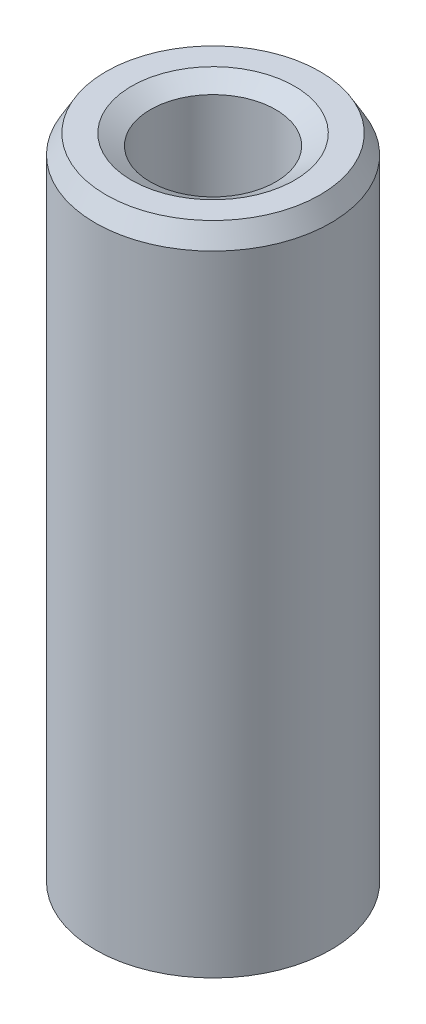
ISO-10303-21;
HEADER;
FILE_DESCRIPTION(('STEP AP214'),'2;1');
FILE_NAME('part.step','',(''),(''),'','','');
FILE_SCHEMA(('AUTOMOTIVE_DESIGN { 1 0 10303 214 1 1 1 1 }'));
ENDSEC;
DATA;
#1=APPLICATION_CONTEXT('core data for automotive mechanical design processes');
#2=APPLICATION_PROTOCOL_DEFINITION('international standard','automotive_design',2000,#1);
#3=PRODUCT_CONTEXT('',#1,'mechanical');
#4=PRODUCT('Part','Part','',(#3));
#5=PRODUCT_RELATED_PRODUCT_CATEGORY('part','',(#4));
#6=PRODUCT_DEFINITION_FORMATION('','',#4);
#7=PRODUCT_DEFINITION_CONTEXT('part definition',#1,'design');
#8=PRODUCT_DEFINITION('design','',#6,#7);
#9=PRODUCT_DEFINITION_SHAPE('','',#8);
#10=(LENGTH_UNIT() NAMED_UNIT(*) SI_UNIT(.MILLI.,.METRE.));
#11=(NAMED_UNIT(*) PLANE_ANGLE_UNIT() SI_UNIT($,.RADIAN.));
#12=(NAMED_UNIT(*) SI_UNIT($,.STERADIAN.) SOLID_ANGLE_UNIT());
#13=UNCERTAINTY_MEASURE_WITH_UNIT(LENGTH_MEASURE(1.E-05),#10,'distance_accuracy_value','');
#14=(GEOMETRIC_REPRESENTATION_CONTEXT(3) GLOBAL_UNCERTAINTY_ASSIGNED_CONTEXT((#13)) GLOBAL_UNIT_ASSIGNED_CONTEXT((#10,
#11,#12)) REPRESENTATION_CONTEXT('',''));
#15=CARTESIAN_POINT('',(0.,0.,0.));
#16=DIRECTION('',(0.,0.,1.));
#17=DIRECTION('',(1.,0.,0.));
#18=AXIS2_PLACEMENT_3D('',#15,#16,#17);
#19=CARTESIAN_POINT('',(0.,97.9081992755644,0.));
#20=DIRECTION('',(0.,-1.,0.));
#21=DIRECTION('',(0.,0.,-1.));
#22=AXIS2_PLACEMENT_3D('',#19,#20,#21);
#23=CYLINDRICAL_SURFACE('',#22,17.5);
#24=CARTESIAN_POINT('',(0.,1.61406199338492,0.));
#25=DIRECTION('',(0.,1.,0.));
#26=DIRECTION('',(0.,0.,1.));
#27=AXIS2_PLACEMENT_3D('',#24,#25,#26);
#28=CIRCLE('',#27,17.5);
#29=CARTESIAN_POINT('',(0.,1.61406199338492,17.5));
#30=VERTEX_POINT('',#29);
#31=EDGE_CURVE('E10',#30,#30,#28,.T.);
#32=ORIENTED_EDGE('',*,*,#31,.T.);
#33=EDGE_LOOP('',(#32));
#34=FACE_BOUND('',#33,.T.);
#35=CARTESIAN_POINT('',(0.,95.1125618964558,0.));
#36=DIRECTION('',(0.,1.,0.));
#37=DIRECTION('',(0.,0.,1.));
#38=AXIS2_PLACEMENT_3D('',#35,#36,#37);
#39=CIRCLE('',#38,17.5);
#40=CARTESIAN_POINT('',(0.,95.1125618964558,17.5));
#41=VERTEX_POINT('',#40);
#42=EDGE_CURVE('E50',#41,#41,#39,.F.);
#43=ORIENTED_EDGE('',*,*,#42,.T.);
#44=EDGE_LOOP('',(#43));
#45=FACE_BOUND('',#44,.T.);
#46=ADVANCED_FACE('F39',(#34,#45),#23,.T.);
#47=CARTESIAN_POINT('',(0.,97.9081992755644,0.));
#48=DIRECTION('',(0.,1.,0.));
#49=DIRECTION('',(0.,0.,1.));
#50=AXIS2_PLACEMENT_3D('',#47,#48,#49);
#51=PLANE('',#50);
#52=CARTESIAN_POINT('',(0.,97.9081992755644,0.));
#53=DIRECTION('',(0.,1.,0.));
#54=DIRECTION('',(0.,0.,1.));
#55=AXIS2_PLACEMENT_3D('',#52,#53,#54);
#56=CIRCLE('',#55,12.1078421650825);
#57=CARTESIAN_POINT('',(0.,97.9081992755644,12.1078421650825));
#58=VERTEX_POINT('',#57);
#59=EDGE_CURVE('E58',#58,#58,#56,.F.);
#60=ORIENTED_EDGE('',*,*,#59,.T.);
#61=EDGE_LOOP('',(#60));
#62=FACE_BOUND('',#61,.T.);
#63=CARTESIAN_POINT('',(0.,97.9081992755644,0.));
#64=DIRECTION('',(0.,1.,0.));
#65=DIRECTION('',(0.,0.,1.));
#66=AXIS2_PLACEMENT_3D('',#63,#64,#65);
#67=CIRCLE('',#66,15.8859380066151);
#68=CARTESIAN_POINT('',(0.,97.9081992755644,15.8859380066151));
#69=VERTEX_POINT('',#68);
#70=EDGE_CURVE('E61',#69,#69,#67,.T.);
#71=ORIENTED_EDGE('',*,*,#70,.T.);
#72=EDGE_LOOP('',(#71));
#73=FACE_BOUND('',#72,.T.);
#74=ADVANCED_FACE('F88',(#62,#73),#51,.T.);
#75=CARTESIAN_POINT('',(0.,0.,0.));
#76=DIRECTION('',(0.,1.,0.));
#77=DIRECTION('',(0.,0.,1.));
#78=AXIS2_PLACEMENT_3D('',#75,#76,#77);
#79=PLANE('',#78);
#80=CARTESIAN_POINT('',(0.,0.,0.));
#81=DIRECTION('',(0.,1.,0.));
#82=DIRECTION('',(0.,0.,1.));
#83=AXIS2_PLACEMENT_3D('',#80,#81,#82);
#84=CIRCLE('',#83,10.9262667793588);
#85=CARTESIAN_POINT('',(0.,0.,10.9262667793588));
#86=VERTEX_POINT('',#85);
#87=EDGE_CURVE('E51',#86,#86,#84,.T.);
#88=ORIENTED_EDGE('',*,*,#87,.T.);
#89=EDGE_LOOP('',(#88));
#90=FACE_BOUND('',#89,.T.);
#91=CARTESIAN_POINT('',(0.,0.,0.));
#92=DIRECTION('',(0.,1.,0.));
#93=DIRECTION('',(0.,0.,1.));
#94=AXIS2_PLACEMENT_3D('',#91,#92,#93);
#95=CIRCLE('',#94,14.7043626208914);
#96=CARTESIAN_POINT('',(0.,0.,14.7043626208914));
#97=VERTEX_POINT('',#96);
#98=EDGE_CURVE('E54',#97,#97,#95,.F.);
#99=ORIENTED_EDGE('',*,*,#98,.T.);
#100=EDGE_LOOP('',(#99));
#101=FACE_BOUND('',#100,.T.);
#102=ADVANCED_FACE('F83',(#90,#101),#79,.F.);
#103=CARTESIAN_POINT('',(0.,97.9081992755644,0.));
#104=DIRECTION('',(0.,-1.,0.));
#105=DIRECTION('',(0.,0.,-1.));
#106=AXIS2_PLACEMENT_3D('',#103,#104,#105);
#107=CYLINDRICAL_SURFACE('',#106,9.31220478597384);
#108=CARTESIAN_POINT('',(0.,96.2941372821795,0.));
#109=DIRECTION('',(0.,1.,0.));
#110=DIRECTION('',(0.,0.,1.));
#111=AXIS2_PLACEMENT_3D('',#108,#109,#110);
#112=CIRCLE('',#111,9.31220478597384);
#113=CARTESIAN_POINT('',(0.,96.2941372821795,9.31220478597384));
#114=VERTEX_POINT('',#113);
#115=EDGE_CURVE('E67',#114,#114,#112,.T.);
#116=ORIENTED_EDGE('',*,*,#115,.T.);
#117=EDGE_LOOP('',(#116));
#118=FACE_BOUND('',#117,.T.);
#119=CARTESIAN_POINT('',(0.,2.79563737910864,0.));
#120=DIRECTION('',(0.,1.,0.));
#121=DIRECTION('',(0.,0.,1.));
#122=AXIS2_PLACEMENT_3D('',#119,#120,#121);
#123=CIRCLE('',#122,9.31220478597384);
#124=CARTESIAN_POINT('',(0.,2.79563737910864,9.31220478597384));
#125=VERTEX_POINT('',#124);
#126=EDGE_CURVE('E69',#125,#125,#123,.F.);
#127=ORIENTED_EDGE('',*,*,#126,.T.);
#128=EDGE_LOOP('',(#127));
#129=FACE_BOUND('',#128,.T.);
#130=ADVANCED_FACE('F71',(#118,#129),#107,.F.);
#131=CARTESIAN_POINT('',(0.,96.2941372821795,0.));
#132=DIRECTION('',(0.,1.,0.));
#133=DIRECTION('',(0.,0.,1.));
#134=AXIS2_PLACEMENT_3D('',#131,#132,#133);
#135=CONICAL_SURFACE('',#134,9.31220478597384,1.04719755119661);
#136=ORIENTED_EDGE('',*,*,#59,.F.);
#137=EDGE_LOOP('',(#136));
#138=FACE_BOUND('',#137,.T.);
#139=ORIENTED_EDGE('',*,*,#115,.F.);
#140=EDGE_LOOP('',(#139));
#141=FACE_BOUND('',#140,.T.);
#142=ADVANCED_FACE('F77',(#138,#141),#135,.F.);
#143=CARTESIAN_POINT('',(0.,0.,0.));
#144=DIRECTION('',(0.,-1.,0.));
#145=DIRECTION('',(0.,0.,-1.));
#146=AXIS2_PLACEMENT_3D('',#143,#144,#145);
#147=CONICAL_SURFACE('',#146,10.9262667793588,0.523598775598295);
#148=ORIENTED_EDGE('',*,*,#126,.F.);
#149=EDGE_LOOP('',(#148));
#150=FACE_BOUND('',#149,.T.);
#151=ORIENTED_EDGE('',*,*,#87,.F.);
#152=EDGE_LOOP('',(#151));
#153=FACE_BOUND('',#152,.T.);
#154=ADVANCED_FACE('F73',(#150,#153),#147,.F.);
#155=CARTESIAN_POINT('',(0.,1.61406199338492,0.));
#156=DIRECTION('',(0.,1.,0.));
#157=DIRECTION('',(0.,0.,1.));
#158=AXIS2_PLACEMENT_3D('',#155,#156,#157);
#159=CONICAL_SURFACE('',#158,17.5,1.0471975511966);
#160=ORIENTED_EDGE('',*,*,#98,.F.);
#161=EDGE_LOOP('',(#160));
#162=FACE_BOUND('',#161,.T.);
#163=ORIENTED_EDGE('',*,*,#31,.F.);
#164=EDGE_LOOP('',(#163));
#165=FACE_BOUND('',#164,.T.);
#166=ADVANCED_FACE('F76',(#162,#165),#159,.T.);
#167=CARTESIAN_POINT('',(0.,97.9081992755644,0.));
#168=DIRECTION('',(0.,-1.,0.));
#169=DIRECTION('',(0.,0.,-1.));
#170=AXIS2_PLACEMENT_3D('',#167,#168,#169);
#171=CONICAL_SURFACE('',#170,15.8859380066151,0.523598775598298);
#172=ORIENTED_EDGE('',*,*,#42,.F.);
#173=EDGE_LOOP('',(#172));
#174=FACE_BOUND('',#173,.T.);
#175=ORIENTED_EDGE('',*,*,#70,.F.);
#176=EDGE_LOOP('',(#175));
#177=FACE_BOUND('',#176,.T.);
#178=ADVANCED_FACE('F45',(#174,#177),#171,.T.);
#179=CLOSED_SHELL('',(#46,#74,#102,#130,#142,#154,#166,#178));
#180=MANIFOLD_SOLID_BREP('B2',#179);
#181=ADVANCED_BREP_SHAPE_REPRESENTATION('',(#18,#180),#14);
#182=SHAPE_DEFINITION_REPRESENTATION(#9,#181);
ENDSEC;
END-ISO-10303-21;
